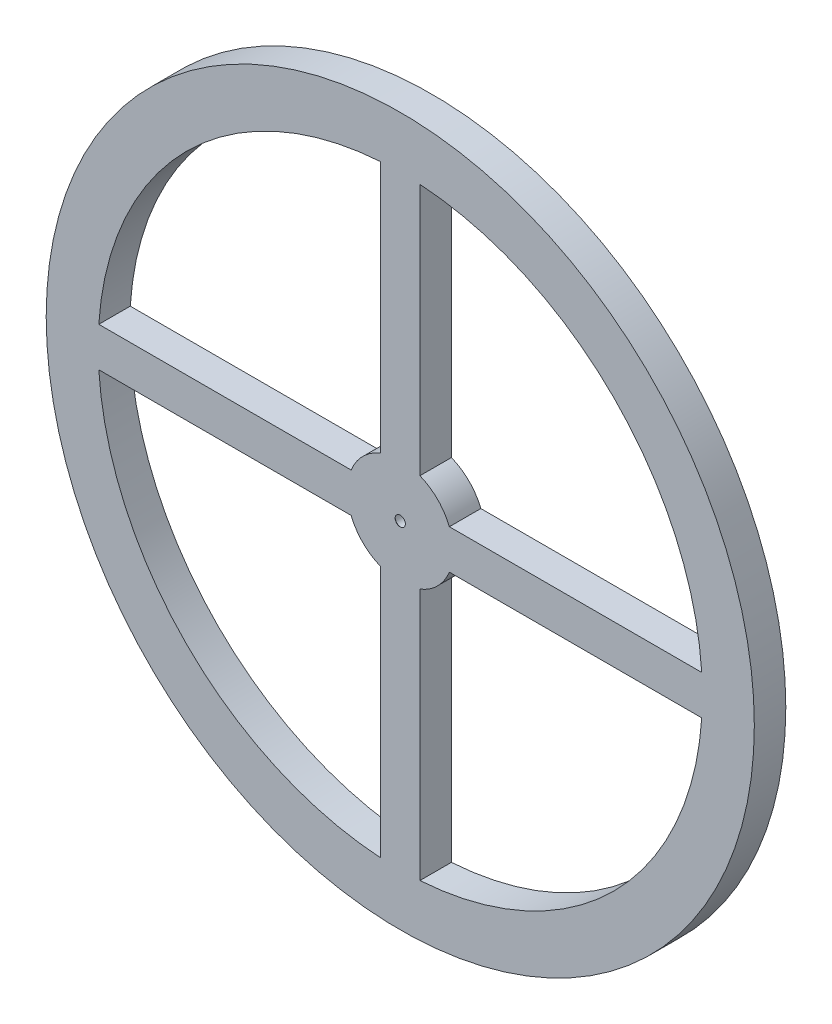
ISO-10303-21;
HEADER;
FILE_DESCRIPTION(('STEP AP214'),'2;1');
FILE_NAME('part.step','',(''),(''),'','','');
FILE_SCHEMA(('AUTOMOTIVE_DESIGN { 1 0 10303 214 1 1 1 1 }'));
ENDSEC;
DATA;
#1=APPLICATION_CONTEXT('core data for automotive mechanical design processes');
#2=APPLICATION_PROTOCOL_DEFINITION('international standard','automotive_design',2000,#1);
#3=PRODUCT_CONTEXT('',#1,'mechanical');
#4=PRODUCT('Part','Part','',(#3));
#5=PRODUCT_RELATED_PRODUCT_CATEGORY('part','',(#4));
#6=PRODUCT_DEFINITION_FORMATION('','',#4);
#7=PRODUCT_DEFINITION_CONTEXT('part definition',#1,'design');
#8=PRODUCT_DEFINITION('design','',#6,#7);
#9=PRODUCT_DEFINITION_SHAPE('','',#8);
#10=(LENGTH_UNIT() NAMED_UNIT(*) SI_UNIT(.MILLI.,.METRE.));
#11=(NAMED_UNIT(*) PLANE_ANGLE_UNIT() SI_UNIT($,.RADIAN.));
#12=(NAMED_UNIT(*) SI_UNIT($,.STERADIAN.) SOLID_ANGLE_UNIT());
#13=UNCERTAINTY_MEASURE_WITH_UNIT(LENGTH_MEASURE(1.E-05),#10,'distance_accuracy_value','');
#14=(GEOMETRIC_REPRESENTATION_CONTEXT(3) GLOBAL_UNCERTAINTY_ASSIGNED_CONTEXT((#13)) GLOBAL_UNIT_ASSIGNED_CONTEXT((#10,
#11,#12)) REPRESENTATION_CONTEXT('',''));
#15=CARTESIAN_POINT('',(0.,0.,0.));
#16=DIRECTION('',(0.,0.,1.));
#17=DIRECTION('',(1.,0.,0.));
#18=AXIS2_PLACEMENT_3D('',#15,#16,#17);
#19=CARTESIAN_POINT('',(0.,0.,4.));
#20=DIRECTION('',(0.,0.,-1.));
#21=DIRECTION('',(-1.,0.,0.));
#22=AXIS2_PLACEMENT_3D('',#19,#20,#21);
#23=CYLINDRICAL_SURFACE('',#22,45.);
#24=CARTESIAN_POINT('',(0.,0.,4.));
#25=DIRECTION('',(0.,0.,1.));
#26=DIRECTION('',(1.,0.,0.));
#27=AXIS2_PLACEMENT_3D('',#24,#25,#26);
#28=CIRCLE('',#27,45.);
#29=CARTESIAN_POINT('',(45.,0.,4.));
#30=VERTEX_POINT('',#29);
#31=EDGE_CURVE('E11',#30,#30,#28,.T.);
#32=ORIENTED_EDGE('',*,*,#31,.F.);
#33=EDGE_LOOP('',(#32));
#34=FACE_BOUND('',#33,.T.);
#35=CARTESIAN_POINT('',(0.,0.,0.));
#36=DIRECTION('',(0.,0.,1.));
#37=DIRECTION('',(1.,0.,0.));
#38=AXIS2_PLACEMENT_3D('',#35,#36,#37);
#39=CIRCLE('',#38,45.);
#40=CARTESIAN_POINT('',(45.,0.,0.));
#41=VERTEX_POINT('',#40);
#42=EDGE_CURVE('E54',#41,#41,#39,.T.);
#43=ORIENTED_EDGE('',*,*,#42,.T.);
#44=EDGE_LOOP('',(#43));
#45=FACE_BOUND('',#44,.T.);
#46=ADVANCED_FACE('F46',(#34,#45),#23,.T.);
#47=CARTESIAN_POINT('',(0.,0.,4.));
#48=DIRECTION('',(0.,0.,1.));
#49=DIRECTION('',(1.,0.,0.));
#50=AXIS2_PLACEMENT_3D('',#47,#48,#49);
#51=PLANE('',#50);
#52=CARTESIAN_POINT('',(0.,0.,4.));
#53=DIRECTION('',(0.,0.,1.));
#54=DIRECTION('',(1.,0.,0.));
#55=AXIS2_PLACEMENT_3D('',#52,#53,#54);
#56=CIRCLE('',#55,38.3947318536654);
#57=CARTESIAN_POINT('',(-38.3132540267055,-2.5,4.));
#58=VERTEX_POINT('',#57);
#59=CARTESIAN_POINT('',(-2.5,-38.3132540267055,4.));
#60=VERTEX_POINT('',#59);
#61=EDGE_CURVE('E62',#58,#60,#56,.T.);
#62=ORIENTED_EDGE('',*,*,#61,.F.);
#63=DIRECTION('',(-1.,0.,0.));
#64=VECTOR('',#63,1.);
#65=CARTESIAN_POINT('',(-38.3132540267055,-2.5,4.));
#66=LINE('',#65,#64);
#67=CARTESIAN_POINT('',(-6.24139161433145,-2.5,4.));
#68=VERTEX_POINT('',#67);
#69=EDGE_CURVE('E178',#68,#58,#66,.T.);
#70=ORIENTED_EDGE('',*,*,#69,.F.);
#71=CARTESIAN_POINT('',(0.,0.,4.));
#72=DIRECTION('',(0.,0.,-1.));
#73=DIRECTION('',(1.,0.,0.));
#74=AXIS2_PLACEMENT_3D('',#71,#72,#73);
#75=CIRCLE('',#74,6.72346408359909);
#76=CARTESIAN_POINT('',(-2.5,-6.24139161433145,4.));
#77=VERTEX_POINT('',#76);
#78=EDGE_CURVE('E181',#77,#68,#75,.T.);
#79=ORIENTED_EDGE('',*,*,#78,.F.);
#80=DIRECTION('',(0.,1.,0.));
#81=VECTOR('',#80,1.);
#82=CARTESIAN_POINT('',(-2.5,-38.3132540267055,4.));
#83=LINE('',#82,#81);
#84=EDGE_CURVE('E187',#60,#77,#83,.T.);
#85=ORIENTED_EDGE('',*,*,#84,.F.);
#86=EDGE_LOOP('',(#62,#70,#79,#85));
#87=FACE_BOUND('',#86,.T.);
#88=CARTESIAN_POINT('',(0.,0.,4.));
#89=DIRECTION('',(0.,0.,1.));
#90=DIRECTION('',(1.,0.,0.));
#91=AXIS2_PLACEMENT_3D('',#88,#89,#90);
#92=CIRCLE('',#91,38.3947318536654);
#93=CARTESIAN_POINT('',(2.5,-38.3132540267055,4.));
#94=VERTEX_POINT('',#93);
#95=CARTESIAN_POINT('',(38.3132540267056,-2.5,4.));
#96=VERTEX_POINT('',#95);
#97=EDGE_CURVE('E193',#94,#96,#92,.T.);
#98=ORIENTED_EDGE('',*,*,#97,.F.);
#99=DIRECTION('',(0.,-1.,0.));
#100=VECTOR('',#99,1.);
#101=CARTESIAN_POINT('',(2.5,-38.3132540267055,4.));
#102=LINE('',#101,#100);
#103=CARTESIAN_POINT('',(2.5,-6.24139161433146,4.));
#104=VERTEX_POINT('',#103);
#105=EDGE_CURVE('E201',#104,#94,#102,.T.);
#106=ORIENTED_EDGE('',*,*,#105,.F.);
#107=CARTESIAN_POINT('',(0.,0.,4.));
#108=DIRECTION('',(0.,0.,-1.));
#109=DIRECTION('',(1.,0.,0.));
#110=AXIS2_PLACEMENT_3D('',#107,#108,#109);
#111=CIRCLE('',#110,6.72346408359909);
#112=CARTESIAN_POINT('',(6.24139161433146,-2.5,4.));
#113=VERTEX_POINT('',#112);
#114=EDGE_CURVE('E215',#113,#104,#111,.T.);
#115=ORIENTED_EDGE('',*,*,#114,.F.);
#116=DIRECTION('',(-1.,0.,0.));
#117=VECTOR('',#116,1.);
#118=CARTESIAN_POINT('',(6.24139161433146,-2.5,4.));
#119=LINE('',#118,#117);
#120=EDGE_CURVE('E212',#96,#113,#119,.T.);
#121=ORIENTED_EDGE('',*,*,#120,.F.);
#122=EDGE_LOOP('',(#98,#106,#115,#121));
#123=FACE_BOUND('',#122,.T.);
#124=CARTESIAN_POINT('',(0.,0.,4.));
#125=DIRECTION('',(0.,0.,1.));
#126=DIRECTION('',(1.,0.,0.));
#127=AXIS2_PLACEMENT_3D('',#124,#125,#126);
#128=CIRCLE('',#127,38.3947318536654);
#129=CARTESIAN_POINT('',(-2.5,38.3132540267055,4.));
#130=VERTEX_POINT('',#129);
#131=CARTESIAN_POINT('',(-38.3132540267055,2.5,4.));
#132=VERTEX_POINT('',#131);
#133=EDGE_CURVE('E222',#130,#132,#128,.T.);
#134=ORIENTED_EDGE('',*,*,#133,.F.);
#135=DIRECTION('',(0.,1.,0.));
#136=VECTOR('',#135,1.);
#137=CARTESIAN_POINT('',(-2.5,6.24139161433146,4.));
#138=LINE('',#137,#136);
#139=CARTESIAN_POINT('',(-2.5,6.24139161433146,4.));
#140=VERTEX_POINT('',#139);
#141=EDGE_CURVE('E233',#140,#130,#138,.T.);
#142=ORIENTED_EDGE('',*,*,#141,.F.);
#143=CARTESIAN_POINT('',(0.,0.,4.));
#144=DIRECTION('',(0.,0.,-1.));
#145=DIRECTION('',(1.,0.,0.));
#146=AXIS2_PLACEMENT_3D('',#143,#144,#145);
#147=CIRCLE('',#146,6.72346408359909);
#148=CARTESIAN_POINT('',(-6.24139161433145,2.5,4.));
#149=VERTEX_POINT('',#148);
#150=EDGE_CURVE('E247',#149,#140,#147,.T.);
#151=ORIENTED_EDGE('',*,*,#150,.F.);
#152=DIRECTION('',(1.,0.,0.));
#153=VECTOR('',#152,1.);
#154=CARTESIAN_POINT('',(-38.3132540267055,2.5,4.));
#155=LINE('',#154,#153);
#156=EDGE_CURVE('E244',#132,#149,#155,.T.);
#157=ORIENTED_EDGE('',*,*,#156,.F.);
#158=EDGE_LOOP('',(#134,#142,#151,#157));
#159=FACE_BOUND('',#158,.T.);
#160=CARTESIAN_POINT('',(0.,0.,4.));
#161=DIRECTION('',(0.,0.,1.));
#162=DIRECTION('',(1.,0.,0.));
#163=AXIS2_PLACEMENT_3D('',#160,#161,#162);
#164=CIRCLE('',#163,38.3947318536654);
#165=CARTESIAN_POINT('',(38.3132540267056,2.5,4.));
#166=VERTEX_POINT('',#165);
#167=CARTESIAN_POINT('',(2.5,38.3132540267055,4.));
#168=VERTEX_POINT('',#167);
#169=EDGE_CURVE('E254',#166,#168,#164,.T.);
#170=ORIENTED_EDGE('',*,*,#169,.F.);
#171=DIRECTION('',(1.,0.,0.));
#172=VECTOR('',#171,1.);
#173=CARTESIAN_POINT('',(6.24139161433146,2.5,4.));
#174=LINE('',#173,#172);
#175=CARTESIAN_POINT('',(6.24139161433146,2.5,4.));
#176=VERTEX_POINT('',#175);
#177=EDGE_CURVE('E265',#176,#166,#174,.T.);
#178=ORIENTED_EDGE('',*,*,#177,.F.);
#179=CARTESIAN_POINT('',(0.,0.,4.));
#180=DIRECTION('',(0.,0.,-1.));
#181=DIRECTION('',(1.,0.,0.));
#182=AXIS2_PLACEMENT_3D('',#179,#180,#181);
#183=CIRCLE('',#182,6.72346408359909);
#184=CARTESIAN_POINT('',(2.5,6.24139161433146,4.));
#185=VERTEX_POINT('',#184);
#186=EDGE_CURVE('E279',#185,#176,#183,.T.);
#187=ORIENTED_EDGE('',*,*,#186,.F.);
#188=DIRECTION('',(0.,-1.,0.));
#189=VECTOR('',#188,1.);
#190=CARTESIAN_POINT('',(2.5,6.24139161433146,4.));
#191=LINE('',#190,#189);
#192=EDGE_CURVE('E276',#168,#185,#191,.T.);
#193=ORIENTED_EDGE('',*,*,#192,.F.);
#194=EDGE_LOOP('',(#170,#178,#187,#193));
#195=FACE_BOUND('',#194,.T.);
#196=CARTESIAN_POINT('',(0.,0.,3.99999999999998));
#197=DIRECTION('',(0.,0.,1.));
#198=DIRECTION('',(1.,0.,0.));
#199=AXIS2_PLACEMENT_3D('',#196,#197,#198);
#200=CIRCLE('',#199,0.649999999999998);
#201=CARTESIAN_POINT('',(0.649999999999998,0.,3.99999999999998));
#202=VERTEX_POINT('',#201);
#203=EDGE_CURVE('E286',#202,#202,#200,.T.);
#204=ORIENTED_EDGE('',*,*,#203,.F.);
#205=EDGE_LOOP('',(#204));
#206=FACE_BOUND('',#205,.T.);
#207=ORIENTED_EDGE('',*,*,#31,.T.);
#208=EDGE_LOOP('',(#207));
#209=FACE_BOUND('',#208,.T.);
#210=ADVANCED_FACE('F317',(#87,#123,#159,#195,#206,#209),#51,.T.);
#211=CARTESIAN_POINT('',(0.,0.,0.));
#212=DIRECTION('',(0.,0.,1.));
#213=DIRECTION('',(1.,0.,0.));
#214=AXIS2_PLACEMENT_3D('',#211,#212,#213);
#215=PLANE('',#214);
#216=DIRECTION('',(-1.,0.,0.));
#217=VECTOR('',#216,1.);
#218=CARTESIAN_POINT('',(-38.3132540267055,-2.5,0.));
#219=LINE('',#218,#217);
#220=CARTESIAN_POINT('',(-6.24139161433145,-2.5,0.));
#221=VERTEX_POINT('',#220);
#222=CARTESIAN_POINT('',(-38.3132540267055,-2.5,0.));
#223=VERTEX_POINT('',#222);
#224=EDGE_CURVE('E168',#221,#223,#219,.T.);
#225=ORIENTED_EDGE('',*,*,#224,.T.);
#226=CARTESIAN_POINT('',(0.,0.,0.));
#227=DIRECTION('',(0.,0.,1.));
#228=DIRECTION('',(1.,0.,0.));
#229=AXIS2_PLACEMENT_3D('',#226,#227,#228);
#230=CIRCLE('',#229,38.3947318536654);
#231=CARTESIAN_POINT('',(-2.5,-38.3132540267055,0.));
#232=VERTEX_POINT('',#231);
#233=EDGE_CURVE('E162',#223,#232,#230,.T.);
#234=ORIENTED_EDGE('',*,*,#233,.T.);
#235=DIRECTION('',(0.,1.,0.));
#236=VECTOR('',#235,1.);
#237=CARTESIAN_POINT('',(-2.5,-38.3132540267055,0.));
#238=LINE('',#237,#236);
#239=CARTESIAN_POINT('',(-2.5,-6.24139161433145,0.));
#240=VERTEX_POINT('',#239);
#241=EDGE_CURVE('E171',#232,#240,#238,.T.);
#242=ORIENTED_EDGE('',*,*,#241,.T.);
#243=CARTESIAN_POINT('',(0.,0.,0.));
#244=DIRECTION('',(0.,0.,-1.));
#245=DIRECTION('',(1.,0.,0.));
#246=AXIS2_PLACEMENT_3D('',#243,#244,#245);
#247=CIRCLE('',#246,6.72346408359909);
#248=EDGE_CURVE('E70',#240,#221,#247,.T.);
#249=ORIENTED_EDGE('',*,*,#248,.T.);
#250=EDGE_LOOP('',(#225,#234,#242,#249));
#251=FACE_BOUND('',#250,.T.);
#252=DIRECTION('',(0.,-1.,0.));
#253=VECTOR('',#252,1.);
#254=CARTESIAN_POINT('',(2.5,-38.3132540267055,0.));
#255=LINE('',#254,#253);
#256=CARTESIAN_POINT('',(2.5,-6.24139161433146,0.));
#257=VERTEX_POINT('',#256);
#258=CARTESIAN_POINT('',(2.5,-38.3132540267055,0.));
#259=VERTEX_POINT('',#258);
#260=EDGE_CURVE('E207',#257,#259,#255,.T.);
#261=ORIENTED_EDGE('',*,*,#260,.T.);
#262=CARTESIAN_POINT('',(0.,0.,0.));
#263=DIRECTION('',(0.,0.,1.));
#264=DIRECTION('',(1.,0.,0.));
#265=AXIS2_PLACEMENT_3D('',#262,#263,#264);
#266=CIRCLE('',#265,38.3947318536654);
#267=CARTESIAN_POINT('',(38.3132540267056,-2.5,0.));
#268=VERTEX_POINT('',#267);
#269=EDGE_CURVE('E197',#259,#268,#266,.T.);
#270=ORIENTED_EDGE('',*,*,#269,.T.);
#271=DIRECTION('',(-1.,0.,0.));
#272=VECTOR('',#271,1.);
#273=CARTESIAN_POINT('',(6.24139161433146,-2.5,0.));
#274=LINE('',#273,#272);
#275=CARTESIAN_POINT('',(6.24139161433146,-2.5,0.));
#276=VERTEX_POINT('',#275);
#277=EDGE_CURVE('E200',#268,#276,#274,.T.);
#278=ORIENTED_EDGE('',*,*,#277,.T.);
#279=CARTESIAN_POINT('',(0.,0.,0.));
#280=DIRECTION('',(0.,0.,-1.));
#281=DIRECTION('',(1.,0.,0.));
#282=AXIS2_PLACEMENT_3D('',#279,#280,#281);
#283=CIRCLE('',#282,6.72346408359909);
#284=EDGE_CURVE('E204',#276,#257,#283,.T.);
#285=ORIENTED_EDGE('',*,*,#284,.T.);
#286=EDGE_LOOP('',(#261,#270,#278,#285));
#287=FACE_BOUND('',#286,.T.);
#288=DIRECTION('',(0.,1.,0.));
#289=VECTOR('',#288,1.);
#290=CARTESIAN_POINT('',(-2.5,6.24139161433146,0.));
#291=LINE('',#290,#289);
#292=CARTESIAN_POINT('',(-2.5,6.24139161433146,0.));
#293=VERTEX_POINT('',#292);
#294=CARTESIAN_POINT('',(-2.5,38.3132540267055,0.));
#295=VERTEX_POINT('',#294);
#296=EDGE_CURVE('E239',#293,#295,#291,.T.);
#297=ORIENTED_EDGE('',*,*,#296,.T.);
#298=CARTESIAN_POINT('',(0.,0.,0.));
#299=DIRECTION('',(0.,0.,1.));
#300=DIRECTION('',(1.,0.,0.));
#301=AXIS2_PLACEMENT_3D('',#298,#299,#300);
#302=CIRCLE('',#301,38.3947318536654);
#303=CARTESIAN_POINT('',(-38.3132540267055,2.5,0.));
#304=VERTEX_POINT('',#303);
#305=EDGE_CURVE('E229',#295,#304,#302,.T.);
#306=ORIENTED_EDGE('',*,*,#305,.T.);
#307=DIRECTION('',(1.,0.,0.));
#308=VECTOR('',#307,1.);
#309=CARTESIAN_POINT('',(-38.3132540267055,2.5,0.));
#310=LINE('',#309,#308);
#311=CARTESIAN_POINT('',(-6.24139161433145,2.5,0.));
#312=VERTEX_POINT('',#311);
#313=EDGE_CURVE('E232',#304,#312,#310,.T.);
#314=ORIENTED_EDGE('',*,*,#313,.T.);
#315=CARTESIAN_POINT('',(0.,0.,0.));
#316=DIRECTION('',(0.,0.,-1.));
#317=DIRECTION('',(1.,0.,0.));
#318=AXIS2_PLACEMENT_3D('',#315,#316,#317);
#319=CIRCLE('',#318,6.72346408359909);
#320=EDGE_CURVE('E236',#312,#293,#319,.T.);
#321=ORIENTED_EDGE('',*,*,#320,.T.);
#322=EDGE_LOOP('',(#297,#306,#314,#321));
#323=FACE_BOUND('',#322,.T.);
#324=DIRECTION('',(1.,0.,0.));
#325=VECTOR('',#324,1.);
#326=CARTESIAN_POINT('',(6.24139161433146,2.5,0.));
#327=LINE('',#326,#325);
#328=CARTESIAN_POINT('',(6.24139161433146,2.5,0.));
#329=VERTEX_POINT('',#328);
#330=CARTESIAN_POINT('',(38.3132540267056,2.5,0.));
#331=VERTEX_POINT('',#330);
#332=EDGE_CURVE('E271',#329,#331,#327,.T.);
#333=ORIENTED_EDGE('',*,*,#332,.T.);
#334=CARTESIAN_POINT('',(0.,0.,0.));
#335=DIRECTION('',(0.,0.,1.));
#336=DIRECTION('',(1.,0.,0.));
#337=AXIS2_PLACEMENT_3D('',#334,#335,#336);
#338=CIRCLE('',#337,38.3947318536654);
#339=CARTESIAN_POINT('',(2.5,38.3132540267055,0.));
#340=VERTEX_POINT('',#339);
#341=EDGE_CURVE('E261',#331,#340,#338,.T.);
#342=ORIENTED_EDGE('',*,*,#341,.T.);
#343=DIRECTION('',(0.,-1.,0.));
#344=VECTOR('',#343,1.);
#345=CARTESIAN_POINT('',(2.5,6.24139161433146,0.));
#346=LINE('',#345,#344);
#347=CARTESIAN_POINT('',(2.5,6.24139161433146,0.));
#348=VERTEX_POINT('',#347);
#349=EDGE_CURVE('E264',#340,#348,#346,.T.);
#350=ORIENTED_EDGE('',*,*,#349,.T.);
#351=CARTESIAN_POINT('',(0.,0.,0.));
#352=DIRECTION('',(0.,0.,-1.));
#353=DIRECTION('',(1.,0.,0.));
#354=AXIS2_PLACEMENT_3D('',#351,#352,#353);
#355=CIRCLE('',#354,6.72346408359909);
#356=EDGE_CURVE('E268',#348,#329,#355,.T.);
#357=ORIENTED_EDGE('',*,*,#356,.T.);
#358=EDGE_LOOP('',(#333,#342,#350,#357));
#359=FACE_BOUND('',#358,.T.);
#360=CARTESIAN_POINT('',(0.,0.,0.));
#361=DIRECTION('',(0.,0.,1.));
#362=DIRECTION('',(1.,0.,0.));
#363=AXIS2_PLACEMENT_3D('',#360,#361,#362);
#364=CIRCLE('',#363,0.749999999999998);
#365=CARTESIAN_POINT('',(0.750000000000005,0.,0.));
#366=VERTEX_POINT('',#365);
#367=EDGE_CURVE('E49',#366,#366,#364,.T.);
#368=ORIENTED_EDGE('',*,*,#367,.T.);
#369=EDGE_LOOP('',(#368));
#370=FACE_BOUND('',#369,.T.);
#371=ORIENTED_EDGE('',*,*,#42,.F.);
#372=EDGE_LOOP('',(#371));
#373=FACE_BOUND('',#372,.T.);
#374=ADVANCED_FACE('F175',(#251,#287,#323,#359,#370,#373),#215,.F.);
#375=CARTESIAN_POINT('',(0.,0.,-12.4));
#376=DIRECTION('',(0.,0.,1.));
#377=DIRECTION('',(1.,0.,0.));
#378=AXIS2_PLACEMENT_3D('',#375,#376,#377);
#379=CYLINDRICAL_SURFACE('',#378,0.749999999999998);
#380=CARTESIAN_POINT('',(0.,0.,3.89999999999998));
#381=DIRECTION('',(0.,0.,1.));
#382=DIRECTION('',(1.,0.,0.));
#383=AXIS2_PLACEMENT_3D('',#380,#381,#382);
#384=CIRCLE('',#383,0.749999999999998);
#385=CARTESIAN_POINT('',(0.749999999999998,0.,3.89999999999998));
#386=VERTEX_POINT('',#385);
#387=EDGE_CURVE('E293',#386,#386,#384,.F.);
#388=ORIENTED_EDGE('',*,*,#387,.F.);
#389=EDGE_LOOP('',(#388));
#390=FACE_BOUND('',#389,.T.);
#391=ORIENTED_EDGE('',*,*,#367,.F.);
#392=EDGE_LOOP('',(#391));
#393=FACE_BOUND('',#392,.T.);
#394=ADVANCED_FACE('F305',(#390,#393),#379,.F.);
#395=CARTESIAN_POINT('',(0.,0.,3.99999999999998));
#396=DIRECTION('',(0.,0.,-1.));
#397=DIRECTION('',(-1.,0.,0.));
#398=AXIS2_PLACEMENT_3D('',#395,#396,#397);
#399=CONICAL_SURFACE('',#398,0.649999999999998,0.785398163397452);
#400=ORIENTED_EDGE('',*,*,#387,.T.);
#401=EDGE_LOOP('',(#400));
#402=FACE_BOUND('',#401,.T.);
#403=ORIENTED_EDGE('',*,*,#203,.T.);
#404=EDGE_LOOP('',(#403));
#405=FACE_BOUND('',#404,.T.);
#406=ADVANCED_FACE('F307',(#402,#405),#399,.F.);
#407=CARTESIAN_POINT('',(0.,0.,0.));
#408=DIRECTION('',(0.,0.,1.));
#409=DIRECTION('',(1.,0.,0.));
#410=AXIS2_PLACEMENT_3D('',#407,#408,#409);
#411=CYLINDRICAL_SURFACE('',#410,38.3947318536654);
#412=ORIENTED_EDGE('',*,*,#169,.T.);
#413=DIRECTION('',(0.,0.,1.));
#414=VECTOR('',#413,1.);
#415=CARTESIAN_POINT('',(2.5,38.3132540267055,0.));
#416=LINE('',#415,#414);
#417=EDGE_CURVE('E274',#340,#168,#416,.T.);
#418=ORIENTED_EDGE('',*,*,#417,.F.);
#419=ORIENTED_EDGE('',*,*,#341,.F.);
#420=DIRECTION('',(0.,0.,1.));
#421=VECTOR('',#420,1.);
#422=CARTESIAN_POINT('',(38.3132540267056,2.5,0.));
#423=LINE('',#422,#421);
#424=EDGE_CURVE('E284',#331,#166,#423,.T.);
#425=ORIENTED_EDGE('',*,*,#424,.T.);
#426=EDGE_LOOP('',(#412,#418,#419,#425));
#427=FACE_BOUND('',#426,.T.);
#428=ADVANCED_FACE('F314',(#427),#411,.F.);
#429=CARTESIAN_POINT('',(6.24139161433146,2.5,0.));
#430=DIRECTION('',(0.,-1.,0.));
#431=DIRECTION('',(1.,0.,0.));
#432=AXIS2_PLACEMENT_3D('',#429,#430,#431);
#433=PLANE('',#432);
#434=ORIENTED_EDGE('',*,*,#177,.T.);
#435=ORIENTED_EDGE('',*,*,#424,.F.);
#436=ORIENTED_EDGE('',*,*,#332,.F.);
#437=DIRECTION('',(0.,0.,1.));
#438=VECTOR('',#437,1.);
#439=CARTESIAN_POINT('',(6.24139161433146,2.5,0.));
#440=LINE('',#439,#438);
#441=EDGE_CURVE('E287',#329,#176,#440,.T.);
#442=ORIENTED_EDGE('',*,*,#441,.T.);
#443=EDGE_LOOP('',(#434,#435,#436,#442));
#444=FACE_BOUND('',#443,.T.);
#445=ADVANCED_FACE('F356',(#444),#433,.F.);
#446=CARTESIAN_POINT('',(0.,0.,0.));
#447=DIRECTION('',(0.,0.,1.));
#448=DIRECTION('',(1.,0.,0.));
#449=AXIS2_PLACEMENT_3D('',#446,#447,#448);
#450=CYLINDRICAL_SURFACE('',#449,6.72346408359909);
#451=ORIENTED_EDGE('',*,*,#186,.T.);
#452=ORIENTED_EDGE('',*,*,#441,.F.);
#453=ORIENTED_EDGE('',*,*,#356,.F.);
#454=DIRECTION('',(0.,0.,1.));
#455=VECTOR('',#454,1.);
#456=CARTESIAN_POINT('',(2.5,6.24139161433146,0.));
#457=LINE('',#456,#455);
#458=EDGE_CURVE('E289',#348,#185,#457,.T.);
#459=ORIENTED_EDGE('',*,*,#458,.T.);
#460=EDGE_LOOP('',(#451,#452,#453,#459));
#461=FACE_BOUND('',#460,.T.);
#462=ADVANCED_FACE('F358',(#461),#450,.T.);
#463=CARTESIAN_POINT('',(2.5,6.24139161433146,0.));
#464=DIRECTION('',(-1.,0.,0.));
#465=DIRECTION('',(0.,0.,1.));
#466=AXIS2_PLACEMENT_3D('',#463,#464,#465);
#467=PLANE('',#466);
#468=ORIENTED_EDGE('',*,*,#192,.T.);
#469=ORIENTED_EDGE('',*,*,#458,.F.);
#470=ORIENTED_EDGE('',*,*,#349,.F.);
#471=ORIENTED_EDGE('',*,*,#417,.T.);
#472=EDGE_LOOP('',(#468,#469,#470,#471));
#473=FACE_BOUND('',#472,.T.);
#474=ADVANCED_FACE('F351',(#473),#467,.F.);
#475=CARTESIAN_POINT('',(0.,0.,0.));
#476=DIRECTION('',(0.,0.,1.));
#477=DIRECTION('',(1.,0.,0.));
#478=AXIS2_PLACEMENT_3D('',#475,#476,#477);
#479=CYLINDRICAL_SURFACE('',#478,38.3947318536654);
#480=ORIENTED_EDGE('',*,*,#133,.T.);
#481=DIRECTION('',(0.,0.,1.));
#482=VECTOR('',#481,1.);
#483=CARTESIAN_POINT('',(-38.3132540267055,2.5,0.));
#484=LINE('',#483,#482);
#485=EDGE_CURVE('E242',#304,#132,#484,.T.);
#486=ORIENTED_EDGE('',*,*,#485,.F.);
#487=ORIENTED_EDGE('',*,*,#305,.F.);
#488=DIRECTION('',(0.,0.,1.));
#489=VECTOR('',#488,1.);
#490=CARTESIAN_POINT('',(-2.5,38.3132540267055,0.));
#491=LINE('',#490,#489);
#492=EDGE_CURVE('E252',#295,#130,#491,.T.);
#493=ORIENTED_EDGE('',*,*,#492,.T.);
#494=EDGE_LOOP('',(#480,#486,#487,#493));
#495=FACE_BOUND('',#494,.T.);
#496=ADVANCED_FACE('F365',(#495),#479,.F.);
#497=CARTESIAN_POINT('',(-2.5,6.24139161433146,0.));
#498=DIRECTION('',(1.,0.,0.));
#499=DIRECTION('',(0.,0.,-1.));
#500=AXIS2_PLACEMENT_3D('',#497,#498,#499);
#501=PLANE('',#500);
#502=ORIENTED_EDGE('',*,*,#141,.T.);
#503=ORIENTED_EDGE('',*,*,#492,.F.);
#504=ORIENTED_EDGE('',*,*,#296,.F.);
#505=DIRECTION('',(0.,0.,1.));
#506=VECTOR('',#505,1.);
#507=CARTESIAN_POINT('',(-2.5,6.24139161433146,0.));
#508=LINE('',#507,#506);
#509=EDGE_CURVE('E255',#293,#140,#508,.T.);
#510=ORIENTED_EDGE('',*,*,#509,.T.);
#511=EDGE_LOOP('',(#502,#503,#504,#510));
#512=FACE_BOUND('',#511,.T.);
#513=ADVANCED_FACE('F399',(#512),#501,.F.);
#514=CARTESIAN_POINT('',(0.,0.,0.));
#515=DIRECTION('',(0.,0.,1.));
#516=DIRECTION('',(1.,0.,0.));
#517=AXIS2_PLACEMENT_3D('',#514,#515,#516);
#518=CYLINDRICAL_SURFACE('',#517,6.72346408359909);
#519=ORIENTED_EDGE('',*,*,#150,.T.);
#520=ORIENTED_EDGE('',*,*,#509,.F.);
#521=ORIENTED_EDGE('',*,*,#320,.F.);
#522=DIRECTION('',(0.,0.,1.));
#523=VECTOR('',#522,1.);
#524=CARTESIAN_POINT('',(-6.24139161433145,2.5,0.));
#525=LINE('',#524,#523);
#526=EDGE_CURVE('E257',#312,#149,#525,.T.);
#527=ORIENTED_EDGE('',*,*,#526,.T.);
#528=EDGE_LOOP('',(#519,#520,#521,#527));
#529=FACE_BOUND('',#528,.T.);
#530=ADVANCED_FACE('F408',(#529),#518,.T.);
#531=CARTESIAN_POINT('',(-38.3132540267055,2.5,0.));
#532=DIRECTION('',(0.,-1.,0.));
#533=DIRECTION('',(0.,0.,-1.));
#534=AXIS2_PLACEMENT_3D('',#531,#532,#533);
#535=PLANE('',#534);
#536=ORIENTED_EDGE('',*,*,#156,.T.);
#537=ORIENTED_EDGE('',*,*,#526,.F.);
#538=ORIENTED_EDGE('',*,*,#313,.F.);
#539=ORIENTED_EDGE('',*,*,#485,.T.);
#540=EDGE_LOOP('',(#536,#537,#538,#539));
#541=FACE_BOUND('',#540,.T.);
#542=ADVANCED_FACE('F418',(#541),#535,.F.);
#543=CARTESIAN_POINT('',(0.,0.,0.));
#544=DIRECTION('',(0.,0.,1.));
#545=DIRECTION('',(1.,0.,0.));
#546=AXIS2_PLACEMENT_3D('',#543,#544,#545);
#547=CYLINDRICAL_SURFACE('',#546,38.3947318536654);
#548=ORIENTED_EDGE('',*,*,#97,.T.);
#549=DIRECTION('',(0.,0.,1.));
#550=VECTOR('',#549,1.);
#551=CARTESIAN_POINT('',(38.3132540267056,-2.5,0.));
#552=LINE('',#551,#550);
#553=EDGE_CURVE('E210',#268,#96,#552,.T.);
#554=ORIENTED_EDGE('',*,*,#553,.F.);
#555=ORIENTED_EDGE('',*,*,#269,.F.);
#556=DIRECTION('',(0.,0.,1.));
#557=VECTOR('',#556,1.);
#558=CARTESIAN_POINT('',(2.5,-38.3132540267055,0.));
#559=LINE('',#558,#557);
#560=EDGE_CURVE('E220',#259,#94,#559,.T.);
#561=ORIENTED_EDGE('',*,*,#560,.T.);
#562=EDGE_LOOP('',(#548,#554,#555,#561));
#563=FACE_BOUND('',#562,.T.);
#564=ADVANCED_FACE('F428',(#563),#547,.F.);
#565=CARTESIAN_POINT('',(2.5,-38.3132540267055,0.));
#566=DIRECTION('',(-1.,0.,0.));
#567=DIRECTION('',(0.,-1.,0.));
#568=AXIS2_PLACEMENT_3D('',#565,#566,#567);
#569=PLANE('',#568);
#570=ORIENTED_EDGE('',*,*,#105,.T.);
#571=ORIENTED_EDGE('',*,*,#560,.F.);
#572=ORIENTED_EDGE('',*,*,#260,.F.);
#573=DIRECTION('',(0.,0.,1.));
#574=VECTOR('',#573,1.);
#575=CARTESIAN_POINT('',(2.5,-6.24139161433146,0.));
#576=LINE('',#575,#574);
#577=EDGE_CURVE('E223',#257,#104,#576,.T.);
#578=ORIENTED_EDGE('',*,*,#577,.T.);
#579=EDGE_LOOP('',(#570,#571,#572,#578));
#580=FACE_BOUND('',#579,.T.);
#581=ADVANCED_FACE('F438',(#580),#569,.F.);
#582=CARTESIAN_POINT('',(0.,0.,0.));
#583=DIRECTION('',(0.,0.,1.));
#584=DIRECTION('',(1.,0.,0.));
#585=AXIS2_PLACEMENT_3D('',#582,#583,#584);
#586=CYLINDRICAL_SURFACE('',#585,6.72346408359909);
#587=ORIENTED_EDGE('',*,*,#114,.T.);
#588=ORIENTED_EDGE('',*,*,#577,.F.);
#589=ORIENTED_EDGE('',*,*,#284,.F.);
#590=DIRECTION('',(0.,0.,1.));
#591=VECTOR('',#590,1.);
#592=CARTESIAN_POINT('',(6.24139161433146,-2.5,0.));
#593=LINE('',#592,#591);
#594=EDGE_CURVE('E225',#276,#113,#593,.T.);
#595=ORIENTED_EDGE('',*,*,#594,.T.);
#596=EDGE_LOOP('',(#587,#588,#589,#595));
#597=FACE_BOUND('',#596,.T.);
#598=ADVANCED_FACE('F448',(#597),#586,.T.);
#599=CARTESIAN_POINT('',(6.24139161433146,-2.5,0.));
#600=DIRECTION('',(0.,1.,0.));
#601=DIRECTION('',(-1.,0.,0.));
#602=AXIS2_PLACEMENT_3D('',#599,#600,#601);
#603=PLANE('',#602);
#604=ORIENTED_EDGE('',*,*,#120,.T.);
#605=ORIENTED_EDGE('',*,*,#594,.F.);
#606=ORIENTED_EDGE('',*,*,#277,.F.);
#607=ORIENTED_EDGE('',*,*,#553,.T.);
#608=EDGE_LOOP('',(#604,#605,#606,#607));
#609=FACE_BOUND('',#608,.T.);
#610=ADVANCED_FACE('F458',(#609),#603,.F.);
#611=CARTESIAN_POINT('',(0.,0.,0.));
#612=DIRECTION('',(0.,0.,1.));
#613=DIRECTION('',(1.,0.,0.));
#614=AXIS2_PLACEMENT_3D('',#611,#612,#613);
#615=CYLINDRICAL_SURFACE('',#614,38.3947318536654);
#616=ORIENTED_EDGE('',*,*,#61,.T.);
#617=DIRECTION('',(0.,0.,1.));
#618=VECTOR('',#617,1.);
#619=CARTESIAN_POINT('',(-2.5,-38.3132540267055,0.));
#620=LINE('',#619,#618);
#621=EDGE_CURVE('E158',#232,#60,#620,.T.);
#622=ORIENTED_EDGE('',*,*,#621,.F.);
#623=ORIENTED_EDGE('',*,*,#233,.F.);
#624=DIRECTION('',(0.,0.,1.));
#625=VECTOR('',#624,1.);
#626=CARTESIAN_POINT('',(-38.3132540267055,-2.5,0.));
#627=LINE('',#626,#625);
#628=EDGE_CURVE('E191',#223,#58,#627,.T.);
#629=ORIENTED_EDGE('',*,*,#628,.T.);
#630=EDGE_LOOP('',(#616,#622,#623,#629));
#631=FACE_BOUND('',#630,.T.);
#632=ADVANCED_FACE('F160',(#631),#615,.F.);
#633=CARTESIAN_POINT('',(-38.3132540267055,-2.5,0.));
#634=DIRECTION('',(0.,1.,0.));
#635=DIRECTION('',(0.,0.,1.));
#636=AXIS2_PLACEMENT_3D('',#633,#634,#635);
#637=PLANE('',#636);
#638=ORIENTED_EDGE('',*,*,#69,.T.);
#639=ORIENTED_EDGE('',*,*,#628,.F.);
#640=ORIENTED_EDGE('',*,*,#224,.F.);
#641=DIRECTION('',(0.,0.,1.));
#642=VECTOR('',#641,1.);
#643=CARTESIAN_POINT('',(-6.24139161433145,-2.5,0.));
#644=LINE('',#643,#642);
#645=EDGE_CURVE('E194',#221,#68,#644,.T.);
#646=ORIENTED_EDGE('',*,*,#645,.T.);
#647=EDGE_LOOP('',(#638,#639,#640,#646));
#648=FACE_BOUND('',#647,.T.);
#649=ADVANCED_FACE('F477',(#648),#637,.F.);
#650=CARTESIAN_POINT('',(0.,0.,0.));
#651=DIRECTION('',(0.,0.,1.));
#652=DIRECTION('',(1.,0.,0.));
#653=AXIS2_PLACEMENT_3D('',#650,#651,#652);
#654=CYLINDRICAL_SURFACE('',#653,6.72346408359909);
#655=ORIENTED_EDGE('',*,*,#78,.T.);
#656=ORIENTED_EDGE('',*,*,#645,.F.);
#657=ORIENTED_EDGE('',*,*,#248,.F.);
#658=DIRECTION('',(0.,0.,1.));
#659=VECTOR('',#658,1.);
#660=CARTESIAN_POINT('',(-2.5,-6.24139161433145,0.));
#661=LINE('',#660,#659);
#662=EDGE_CURVE('E167',#240,#77,#661,.T.);
#663=ORIENTED_EDGE('',*,*,#662,.T.);
#664=EDGE_LOOP('',(#655,#656,#657,#663));
#665=FACE_BOUND('',#664,.T.);
#666=ADVANCED_FACE('F486',(#665),#654,.T.);
#667=CARTESIAN_POINT('',(-2.5,-38.3132540267055,0.));
#668=DIRECTION('',(1.,0.,0.));
#669=DIRECTION('',(0.,1.,0.));
#670=AXIS2_PLACEMENT_3D('',#667,#668,#669);
#671=PLANE('',#670);
#672=ORIENTED_EDGE('',*,*,#84,.T.);
#673=ORIENTED_EDGE('',*,*,#662,.F.);
#674=ORIENTED_EDGE('',*,*,#241,.F.);
#675=ORIENTED_EDGE('',*,*,#621,.T.);
#676=EDGE_LOOP('',(#672,#673,#674,#675));
#677=FACE_BOUND('',#676,.T.);
#678=ADVANCED_FACE('F172',(#677),#671,.F.);
#679=CLOSED_SHELL('',(#46,#210,#374,#394,#406,#428,#445,#462,#474,#496,#513,#530,#542,#564,#581,
#598,#610,#632,#649,#666,#678));
#680=MANIFOLD_SOLID_BREP('B2',#679);
#681=ADVANCED_BREP_SHAPE_REPRESENTATION('',(#18,#680),#14);
#682=SHAPE_DEFINITION_REPRESENTATION(#9,#681);
ENDSEC;
END-ISO-10303-21;
